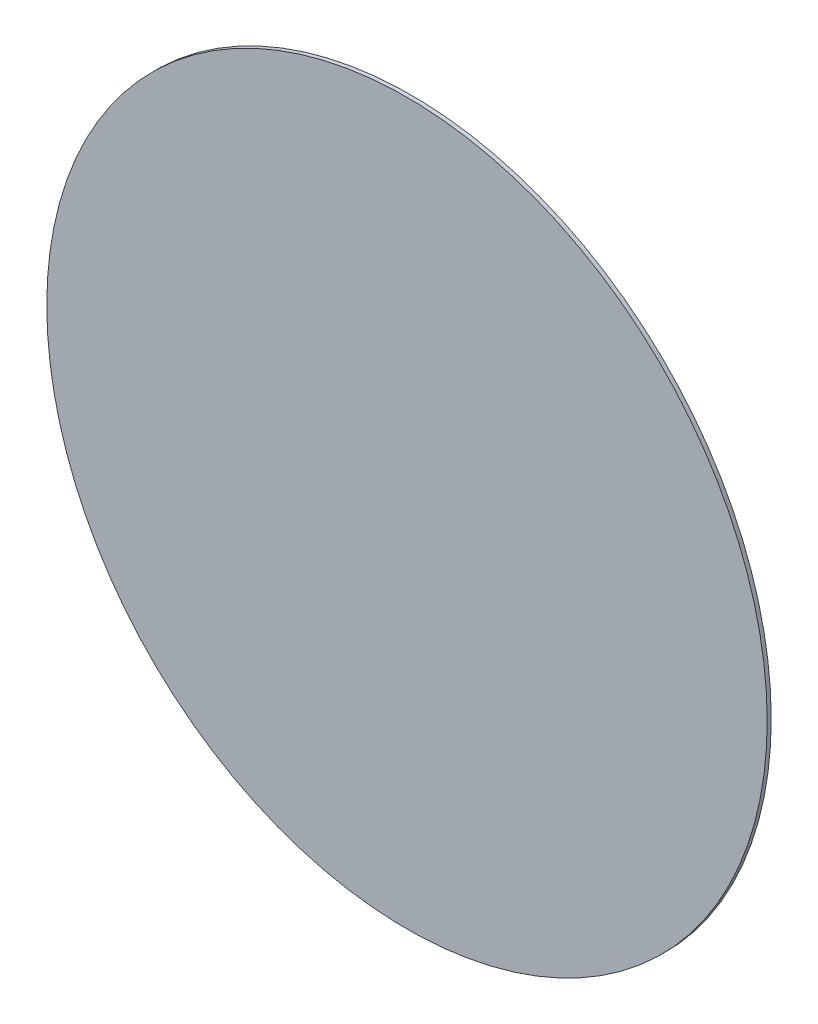
ISO-10303-21;
HEADER;
FILE_DESCRIPTION(('STEP AP214'),'2;1');
FILE_NAME('part.step','',(''),(''),'','','');
FILE_SCHEMA(('AUTOMOTIVE_DESIGN { 1 0 10303 214 1 1 1 1 }'));
ENDSEC;
DATA;
#1=APPLICATION_CONTEXT('core data for automotive mechanical design processes');
#2=APPLICATION_PROTOCOL_DEFINITION('international standard','automotive_design',2000,#1);
#3=PRODUCT_CONTEXT('',#1,'mechanical');
#4=PRODUCT('Part','Part','',(#3));
#5=PRODUCT_RELATED_PRODUCT_CATEGORY('part','',(#4));
#6=PRODUCT_DEFINITION_FORMATION('','',#4);
#7=PRODUCT_DEFINITION_CONTEXT('part definition',#1,'design');
#8=PRODUCT_DEFINITION('design','',#6,#7);
#9=PRODUCT_DEFINITION_SHAPE('','',#8);
#10=(LENGTH_UNIT() NAMED_UNIT(*) SI_UNIT(.MILLI.,.METRE.));
#11=(NAMED_UNIT(*) PLANE_ANGLE_UNIT() SI_UNIT($,.RADIAN.));
#12=(NAMED_UNIT(*) SI_UNIT($,.STERADIAN.) SOLID_ANGLE_UNIT());
#13=UNCERTAINTY_MEASURE_WITH_UNIT(LENGTH_MEASURE(1.E-05),#10,'distance_accuracy_value','');
#14=(GEOMETRIC_REPRESENTATION_CONTEXT(3) GLOBAL_UNCERTAINTY_ASSIGNED_CONTEXT((#13)) GLOBAL_UNIT_ASSIGNED_CONTEXT((#10,
#11,#12)) REPRESENTATION_CONTEXT('',''));
#15=CARTESIAN_POINT('',(0.,0.,0.));
#16=DIRECTION('',(0.,0.,1.));
#17=DIRECTION('',(1.,0.,0.));
#18=AXIS2_PLACEMENT_3D('',#15,#16,#17);
#19=CARTESIAN_POINT('',(0.,0.,0.09921875));
#20=DIRECTION('',(0.,0.,-1.));
#21=DIRECTION('',(-1.,0.,0.));
#22=AXIS2_PLACEMENT_3D('',#19,#20,#21);
#23=CYLINDRICAL_SURFACE('',#22,8.89);
#24=CARTESIAN_POINT('',(0.,0.,0.09921875));
#25=DIRECTION('',(0.,0.,1.));
#26=DIRECTION('',(1.,0.,0.));
#27=AXIS2_PLACEMENT_3D('',#24,#25,#26);
#28=CIRCLE('',#27,8.89);
#29=CARTESIAN_POINT('',(8.89,0.,0.09921875));
#30=VERTEX_POINT('',#29);
#31=EDGE_CURVE('E10',#30,#30,#28,.T.);
#32=ORIENTED_EDGE('',*,*,#31,.F.);
#33=EDGE_LOOP('',(#32));
#34=FACE_BOUND('',#33,.T.);
#35=CARTESIAN_POINT('',(0.,0.,0.));
#36=DIRECTION('',(0.,0.,1.));
#37=DIRECTION('',(1.,0.,0.));
#38=AXIS2_PLACEMENT_3D('',#35,#36,#37);
#39=CIRCLE('',#38,8.89);
#40=CARTESIAN_POINT('',(8.89,0.,0.));
#41=VERTEX_POINT('',#40);
#42=EDGE_CURVE('E34',#41,#41,#39,.T.);
#43=ORIENTED_EDGE('',*,*,#42,.T.);
#44=EDGE_LOOP('',(#43));
#45=FACE_BOUND('',#44,.T.);
#46=ADVANCED_FACE('F31',(#34,#45),#23,.T.);
#47=CARTESIAN_POINT('',(0.,0.,0.09921875));
#48=DIRECTION('',(0.,0.,1.));
#49=DIRECTION('',(1.,0.,0.));
#50=AXIS2_PLACEMENT_3D('',#47,#48,#49);
#51=PLANE('',#50);
#52=ORIENTED_EDGE('',*,*,#31,.T.);
#53=EDGE_LOOP('',(#52));
#54=FACE_BOUND('',#53,.T.);
#55=ADVANCED_FACE('F46',(#54),#51,.T.);
#56=CARTESIAN_POINT('',(0.,0.,0.));
#57=DIRECTION('',(0.,0.,1.));
#58=DIRECTION('',(1.,0.,0.));
#59=AXIS2_PLACEMENT_3D('',#56,#57,#58);
#60=PLANE('',#59);
#61=ORIENTED_EDGE('',*,*,#42,.F.);
#62=EDGE_LOOP('',(#61));
#63=FACE_BOUND('',#62,.T.);
#64=ADVANCED_FACE('F44',(#63),#60,.F.);
#65=CLOSED_SHELL('',(#46,#55,#64));
#66=MANIFOLD_SOLID_BREP('B2',#65);
#67=ADVANCED_BREP_SHAPE_REPRESENTATION('',(#18,#66),#14);
#68=SHAPE_DEFINITION_REPRESENTATION(#9,#67);
ENDSEC;
END-ISO-10303-21;
